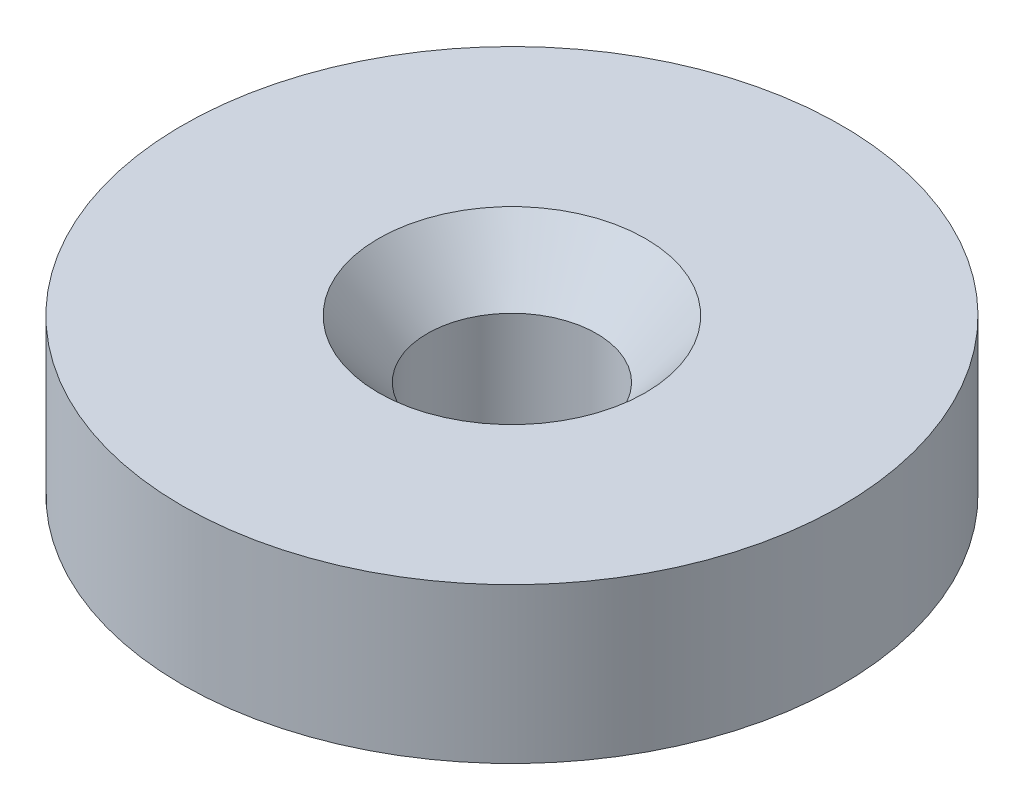
ISO-10303-21;
HEADER;
FILE_DESCRIPTION(('STEP AP214'),'2;1');
FILE_NAME('part.step','',(''),(''),'','','');
FILE_SCHEMA(('AUTOMOTIVE_DESIGN { 1 0 10303 214 1 1 1 1 }'));
ENDSEC;
DATA;
#1=APPLICATION_CONTEXT('core data for automotive mechanical design processes');
#2=APPLICATION_PROTOCOL_DEFINITION('international standard','automotive_design',2000,#1);
#3=PRODUCT_CONTEXT('',#1,'mechanical');
#4=PRODUCT('Part','Part','',(#3));
#5=PRODUCT_RELATED_PRODUCT_CATEGORY('part','',(#4));
#6=PRODUCT_DEFINITION_FORMATION('','',#4);
#7=PRODUCT_DEFINITION_CONTEXT('part definition',#1,'design');
#8=PRODUCT_DEFINITION('design','',#6,#7);
#9=PRODUCT_DEFINITION_SHAPE('','',#8);
#10=(LENGTH_UNIT() NAMED_UNIT(*) SI_UNIT(.MILLI.,.METRE.));
#11=(NAMED_UNIT(*) PLANE_ANGLE_UNIT() SI_UNIT($,.RADIAN.));
#12=(NAMED_UNIT(*) SI_UNIT($,.STERADIAN.) SOLID_ANGLE_UNIT());
#13=UNCERTAINTY_MEASURE_WITH_UNIT(LENGTH_MEASURE(1.E-05),#10,'distance_accuracy_value','');
#14=(GEOMETRIC_REPRESENTATION_CONTEXT(3) GLOBAL_UNCERTAINTY_ASSIGNED_CONTEXT((#13)) GLOBAL_UNIT_ASSIGNED_CONTEXT((#10,
#11,#12)) REPRESENTATION_CONTEXT('',''));
#15=CARTESIAN_POINT('',(0.,0.,0.));
#16=DIRECTION('',(0.,0.,1.));
#17=DIRECTION('',(1.,0.,0.));
#18=AXIS2_PLACEMENT_3D('',#15,#16,#17);
#19=CARTESIAN_POINT('',(0.,28.907284429624,0.));
#20=DIRECTION('',(0.,1.,0.));
#21=DIRECTION('',(0.,0.,1.));
#22=AXIS2_PLACEMENT_3D('',#19,#20,#21);
#23=CYLINDRICAL_SURFACE('',#22,2.56774288414331);
#24=CARTESIAN_POINT('',(0.,0.,0.));
#25=DIRECTION('',(0.,1.,0.));
#26=DIRECTION('',(0.,0.,1.));
#27=AXIS2_PLACEMENT_3D('',#24,#25,#26);
#28=CIRCLE('',#27,2.56774288414331);
#29=CARTESIAN_POINT('',(0.,0.,2.56774288414331));
#30=VERTEX_POINT('',#29);
#31=EDGE_CURVE('E10',#30,#30,#28,.T.);
#32=ORIENTED_EDGE('',*,*,#31,.F.);
#33=EDGE_LOOP('',(#32));
#34=FACE_BOUND('',#33,.T.);
#35=CARTESIAN_POINT('',(0.,2.94654582332006,0.));
#36=DIRECTION('',(0.,1.,0.));
#37=DIRECTION('',(0.,0.,1.));
#38=AXIS2_PLACEMENT_3D('',#35,#36,#37);
#39=CIRCLE('',#38,2.56774288414331);
#40=CARTESIAN_POINT('',(0.,2.94654582332006,2.56774288414331));
#41=VERTEX_POINT('',#40);
#42=EDGE_CURVE('E60',#41,#41,#39,.T.);
#43=ORIENTED_EDGE('',*,*,#42,.T.);
#44=EDGE_LOOP('',(#43));
#45=FACE_BOUND('',#44,.T.);
#46=ADVANCED_FACE('F37',(#34,#45),#23,.F.);
#47=CARTESIAN_POINT('',(0.,0.,-2.56774288414331));
#48=DIRECTION('',(0.,1.,0.));
#49=DIRECTION('',(0.,0.,1.));
#50=AXIS2_PLACEMENT_3D('',#47,#48,#49);
#51=PLANE('',#50);
#52=CARTESIAN_POINT('',(0.,0.,0.));
#53=DIRECTION('',(0.,1.,0.));
#54=DIRECTION('',(0.,0.,1.));
#55=AXIS2_PLACEMENT_3D('',#52,#53,#54);
#56=CIRCLE('',#55,10.);
#57=CARTESIAN_POINT('',(0.,0.,10.));
#58=VERTEX_POINT('',#57);
#59=EDGE_CURVE('E44',#58,#58,#56,.T.);
#60=ORIENTED_EDGE('',*,*,#59,.F.);
#61=EDGE_LOOP('',(#60));
#62=FACE_BOUND('',#61,.T.);
#63=ORIENTED_EDGE('',*,*,#31,.T.);
#64=EDGE_LOOP('',(#63));
#65=FACE_BOUND('',#64,.T.);
#66=ADVANCED_FACE('F80',(#62,#65),#51,.F.);
#67=CARTESIAN_POINT('',(0.,28.907284429624,0.));
#68=DIRECTION('',(0.,1.,0.));
#69=DIRECTION('',(0.,0.,1.));
#70=AXIS2_PLACEMENT_3D('',#67,#68,#69);
#71=CYLINDRICAL_SURFACE('',#70,10.);
#72=CARTESIAN_POINT('',(0.,4.7,0.));
#73=DIRECTION('',(0.,1.,0.));
#74=DIRECTION('',(0.,0.,1.));
#75=AXIS2_PLACEMENT_3D('',#72,#73,#74);
#76=CIRCLE('',#75,10.);
#77=CARTESIAN_POINT('',(0.,4.7,10.));
#78=VERTEX_POINT('',#77);
#79=EDGE_CURVE('E49',#78,#78,#76,.T.);
#80=ORIENTED_EDGE('',*,*,#79,.F.);
#81=EDGE_LOOP('',(#80));
#82=FACE_BOUND('',#81,.T.);
#83=ORIENTED_EDGE('',*,*,#59,.T.);
#84=EDGE_LOOP('',(#83));
#85=FACE_BOUND('',#84,.T.);
#86=ADVANCED_FACE('F75',(#82,#85),#71,.T.);
#87=CARTESIAN_POINT('',(0.,4.7,-10.));
#88=DIRECTION('',(0.,-1.,0.));
#89=DIRECTION('',(0.,0.,-1.));
#90=AXIS2_PLACEMENT_3D('',#87,#88,#89);
#91=PLANE('',#90);
#92=CARTESIAN_POINT('',(0.,4.7,0.));
#93=DIRECTION('',(0.,1.,0.));
#94=DIRECTION('',(0.,0.,1.));
#95=AXIS2_PLACEMENT_3D('',#92,#93,#94);
#96=CIRCLE('',#95,4.05143487979557);
#97=CARTESIAN_POINT('',(0.,4.7,4.05143487979557));
#98=VERTEX_POINT('',#97);
#99=EDGE_CURVE('E54',#98,#98,#96,.T.);
#100=ORIENTED_EDGE('',*,*,#99,.F.);
#101=EDGE_LOOP('',(#100));
#102=FACE_BOUND('',#101,.T.);
#103=ORIENTED_EDGE('',*,*,#79,.T.);
#104=EDGE_LOOP('',(#103));
#105=FACE_BOUND('',#104,.T.);
#106=ADVANCED_FACE('F69',(#102,#105),#91,.F.);
#107=CARTESIAN_POINT('',(0.,4.7,0.));
#108=DIRECTION('',(0.,1.,0.));
#109=DIRECTION('',(0.,0.,1.));
#110=AXIS2_PLACEMENT_3D('',#107,#108,#109);
#111=CONICAL_SURFACE('',#110,4.05143487979557,0.702256931509008);
#112=ORIENTED_EDGE('',*,*,#42,.F.);
#113=EDGE_LOOP('',(#112));
#114=FACE_BOUND('',#113,.T.);
#115=ORIENTED_EDGE('',*,*,#99,.T.);
#116=EDGE_LOOP('',(#115));
#117=FACE_BOUND('',#116,.T.);
#118=ADVANCED_FACE('F66',(#114,#117),#111,.F.);
#119=CLOSED_SHELL('',(#46,#66,#86,#106,#118));
#120=MANIFOLD_SOLID_BREP('B2',#119);
#121=ADVANCED_BREP_SHAPE_REPRESENTATION('',(#18,#120),#14);
#122=SHAPE_DEFINITION_REPRESENTATION(#9,#121);
ENDSEC;
END-ISO-10303-21;
